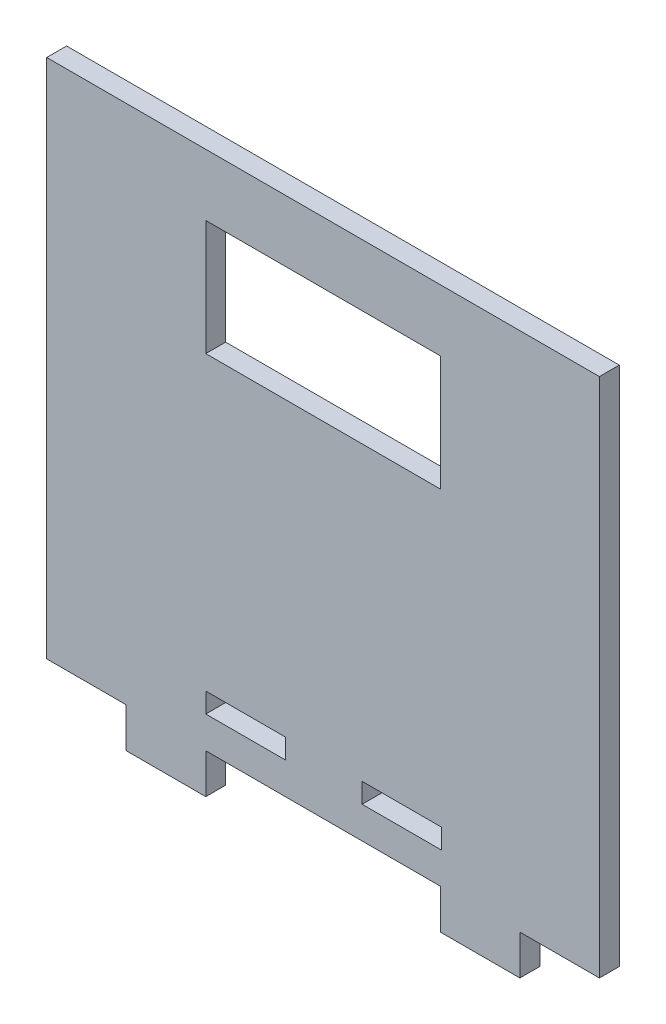
ISO-10303-21;
HEADER;
FILE_DESCRIPTION(('STEP AP214'),'2;1');
FILE_NAME('part.step','',(''),(''),'','','');
FILE_SCHEMA(('AUTOMOTIVE_DESIGN { 1 0 10303 214 1 1 1 1 }'));
ENDSEC;
DATA;
#1=APPLICATION_CONTEXT('core data for automotive mechanical design processes');
#2=APPLICATION_PROTOCOL_DEFINITION('international standard','automotive_design',2000,#1);
#3=PRODUCT_CONTEXT('',#1,'mechanical');
#4=PRODUCT('Part','Part','',(#3));
#5=PRODUCT_RELATED_PRODUCT_CATEGORY('part','',(#4));
#6=PRODUCT_DEFINITION_FORMATION('','',#4);
#7=PRODUCT_DEFINITION_CONTEXT('part definition',#1,'design');
#8=PRODUCT_DEFINITION('design','',#6,#7);
#9=PRODUCT_DEFINITION_SHAPE('','',#8);
#10=(LENGTH_UNIT() NAMED_UNIT(*) SI_UNIT(.MILLI.,.METRE.));
#11=(NAMED_UNIT(*) PLANE_ANGLE_UNIT() SI_UNIT($,.RADIAN.));
#12=(NAMED_UNIT(*) SI_UNIT($,.STERADIAN.) SOLID_ANGLE_UNIT());
#13=UNCERTAINTY_MEASURE_WITH_UNIT(LENGTH_MEASURE(1.E-05),#10,'distance_accuracy_value','');
#14=(GEOMETRIC_REPRESENTATION_CONTEXT(3) GLOBAL_UNCERTAINTY_ASSIGNED_CONTEXT((#13)) GLOBAL_UNIT_ASSIGNED_CONTEXT((#10,
#11,#12)) REPRESENTATION_CONTEXT('',''));
#15=CARTESIAN_POINT('',(0.,0.,0.));
#16=DIRECTION('',(0.,0.,1.));
#17=DIRECTION('',(1.,0.,0.));
#18=AXIS2_PLACEMENT_3D('',#15,#16,#17);
#19=CARTESIAN_POINT('',(0.,-57.5,5.));
#20=DIRECTION('',(0.,-1.,0.));
#21=DIRECTION('',(0.,0.,-1.));
#22=AXIS2_PLACEMENT_3D('',#19,#20,#21);
#23=PLANE('',#22);
#24=DIRECTION('',(-1.,0.,0.));
#25=VECTOR('',#24,1.);
#26=CARTESIAN_POINT('',(0.,-57.5,0.));
#27=LINE('',#26,#25);
#28=CARTESIAN_POINT('',(29.8195040588012,-57.5,0.));
#29=VERTEX_POINT('',#28);
#30=CARTESIAN_POINT('',(9.81950405880117,-57.5,0.));
#31=VERTEX_POINT('',#30);
#32=EDGE_CURVE('E282',#29,#31,#27,.T.);
#33=ORIENTED_EDGE('',*,*,#32,.T.);
#34=DIRECTION('',(0.,0.,-1.));
#35=VECTOR('',#34,1.);
#36=CARTESIAN_POINT('',(9.81950405880117,-57.5,5.));
#37=LINE('',#36,#35);
#38=CARTESIAN_POINT('',(9.81950405880117,-57.5,5.));
#39=VERTEX_POINT('',#38);
#40=EDGE_CURVE('E11',#39,#31,#37,.T.);
#41=ORIENTED_EDGE('',*,*,#40,.F.);
#42=DIRECTION('',(-1.,0.,0.));
#43=VECTOR('',#42,1.);
#44=CARTESIAN_POINT('',(0.,-57.5,5.));
#45=LINE('',#44,#43);
#46=CARTESIAN_POINT('',(29.8195040588012,-57.5,5.));
#47=VERTEX_POINT('',#46);
#48=EDGE_CURVE('E210',#47,#39,#45,.T.);
#49=ORIENTED_EDGE('',*,*,#48,.F.);
#50=DIRECTION('',(0.,0.,-1.));
#51=VECTOR('',#50,1.);
#52=CARTESIAN_POINT('',(29.8195040588012,-57.5,5.));
#53=LINE('',#52,#51);
#54=EDGE_CURVE('E54',#47,#29,#53,.T.);
#55=ORIENTED_EDGE('',*,*,#54,.T.);
#56=EDGE_LOOP('',(#33,#41,#49,#55));
#57=FACE_BOUND('',#56,.T.);
#58=ADVANCED_FACE('F35',(#57),#23,.F.);
#59=CARTESIAN_POINT('',(9.81950405880117,0.,5.));
#60=DIRECTION('',(-1.,0.,0.));
#61=DIRECTION('',(0.,0.,1.));
#62=AXIS2_PLACEMENT_3D('',#59,#60,#61);
#63=PLANE('',#62);
#64=DIRECTION('',(0.,1.,0.));
#65=VECTOR('',#64,1.);
#66=CARTESIAN_POINT('',(9.81950405880117,0.,0.));
#67=LINE('',#66,#65);
#68=CARTESIAN_POINT('',(9.81950405880117,-52.5,0.));
#69=VERTEX_POINT('',#68);
#70=EDGE_CURVE('E216',#31,#69,#67,.T.);
#71=ORIENTED_EDGE('',*,*,#70,.T.);
#72=DIRECTION('',(0.,0.,-1.));
#73=VECTOR('',#72,1.);
#74=CARTESIAN_POINT('',(9.81950405880117,-52.5,5.));
#75=LINE('',#74,#73);
#76=CARTESIAN_POINT('',(9.81950405880117,-52.5,5.));
#77=VERTEX_POINT('',#76);
#78=EDGE_CURVE('E45',#77,#69,#75,.T.);
#79=ORIENTED_EDGE('',*,*,#78,.F.);
#80=DIRECTION('',(0.,1.,0.));
#81=VECTOR('',#80,1.);
#82=CARTESIAN_POINT('',(9.81950405880117,0.,5.));
#83=LINE('',#82,#81);
#84=EDGE_CURVE('E204',#39,#77,#83,.T.);
#85=ORIENTED_EDGE('',*,*,#84,.F.);
#86=ORIENTED_EDGE('',*,*,#40,.T.);
#87=EDGE_LOOP('',(#71,#79,#85,#86));
#88=FACE_BOUND('',#87,.T.);
#89=ADVANCED_FACE('F215',(#88),#63,.F.);
#90=CARTESIAN_POINT('',(0.,-52.5,5.));
#91=DIRECTION('',(0.,-1.,0.));
#92=DIRECTION('',(0.,0.,-1.));
#93=AXIS2_PLACEMENT_3D('',#90,#91,#92);
#94=PLANE('',#93);
#95=DIRECTION('',(-1.,0.,0.));
#96=VECTOR('',#95,1.);
#97=CARTESIAN_POINT('',(0.,-52.5,0.));
#98=LINE('',#97,#96);
#99=CARTESIAN_POINT('',(29.8195040588012,-52.5,0.));
#100=VERTEX_POINT('',#99);
#101=EDGE_CURVE('E285',#100,#69,#98,.T.);
#102=ORIENTED_EDGE('',*,*,#101,.F.);
#103=DIRECTION('',(0.,0.,-1.));
#104=VECTOR('',#103,1.);
#105=CARTESIAN_POINT('',(29.8195040588012,-52.5,5.));
#106=LINE('',#105,#104);
#107=CARTESIAN_POINT('',(29.8195040588012,-52.5,5.));
#108=VERTEX_POINT('',#107);
#109=EDGE_CURVE('E128',#108,#100,#106,.T.);
#110=ORIENTED_EDGE('',*,*,#109,.F.);
#111=DIRECTION('',(-1.,0.,0.));
#112=VECTOR('',#111,1.);
#113=CARTESIAN_POINT('',(0.,-52.5,5.));
#114=LINE('',#113,#112);
#115=EDGE_CURVE('E209',#108,#77,#114,.T.);
#116=ORIENTED_EDGE('',*,*,#115,.T.);
#117=ORIENTED_EDGE('',*,*,#78,.T.);
#118=EDGE_LOOP('',(#102,#110,#116,#117));
#119=FACE_BOUND('',#118,.T.);
#120=ADVANCED_FACE('F220',(#119),#94,.T.);
#121=CARTESIAN_POINT('',(69.5,0.,5.));
#122=DIRECTION('',(1.,0.,0.));
#123=DIRECTION('',(0.,0.,-1.));
#124=AXIS2_PLACEMENT_3D('',#121,#122,#123);
#125=PLANE('',#124);
#126=DIRECTION('',(0.,-1.,0.));
#127=VECTOR('',#126,1.);
#128=CARTESIAN_POINT('',(69.5,0.,0.));
#129=LINE('',#128,#127);
#130=CARTESIAN_POINT('',(69.5,65.5,0.));
#131=VERTEX_POINT('',#130);
#132=CARTESIAN_POINT('',(69.5,-65.5,0.));
#133=VERTEX_POINT('',#132);
#134=EDGE_CURVE('E250',#131,#133,#129,.T.);
#135=ORIENTED_EDGE('',*,*,#134,.F.);
#136=DIRECTION('',(0.,0.,-1.));
#137=VECTOR('',#136,1.);
#138=CARTESIAN_POINT('',(69.5,65.5,5.));
#139=LINE('',#138,#137);
#140=CARTESIAN_POINT('',(69.5,65.5,5.));
#141=VERTEX_POINT('',#140);
#142=EDGE_CURVE('E292',#141,#131,#139,.T.);
#143=ORIENTED_EDGE('',*,*,#142,.F.);
#144=DIRECTION('',(0.,-1.,0.));
#145=VECTOR('',#144,1.);
#146=CARTESIAN_POINT('',(69.5,0.,5.));
#147=LINE('',#146,#145);
#148=CARTESIAN_POINT('',(69.5,-65.5,5.));
#149=VERTEX_POINT('',#148);
#150=EDGE_CURVE('E372',#141,#149,#147,.T.);
#151=ORIENTED_EDGE('',*,*,#150,.T.);
#152=DIRECTION('',(0.,0.,-1.));
#153=VECTOR('',#152,1.);
#154=CARTESIAN_POINT('',(69.5,-65.5,5.));
#155=LINE('',#154,#153);
#156=EDGE_CURVE('E294',#149,#133,#155,.T.);
#157=ORIENTED_EDGE('',*,*,#156,.T.);
#158=EDGE_LOOP('',(#135,#143,#151,#157));
#159=FACE_BOUND('',#158,.T.);
#160=ADVANCED_FACE('F429',(#159),#125,.T.);
#161=CARTESIAN_POINT('',(0.,65.5,5.));
#162=DIRECTION('',(0.,1.,0.));
#163=DIRECTION('',(0.,0.,1.));
#164=AXIS2_PLACEMENT_3D('',#161,#162,#163);
#165=PLANE('',#164);
#166=DIRECTION('',(1.,0.,0.));
#167=VECTOR('',#166,1.);
#168=CARTESIAN_POINT('',(0.,65.5,0.));
#169=LINE('',#168,#167);
#170=CARTESIAN_POINT('',(-69.5,65.5,0.));
#171=VERTEX_POINT('',#170);
#172=EDGE_CURVE('E253',#171,#131,#169,.T.);
#173=ORIENTED_EDGE('',*,*,#172,.F.);
#174=DIRECTION('',(0.,0.,-1.));
#175=VECTOR('',#174,1.);
#176=CARTESIAN_POINT('',(-69.5,65.5,5.));
#177=LINE('',#176,#175);
#178=CARTESIAN_POINT('',(-69.5,65.5,5.));
#179=VERTEX_POINT('',#178);
#180=EDGE_CURVE('E320',#179,#171,#177,.T.);
#181=ORIENTED_EDGE('',*,*,#180,.F.);
#182=DIRECTION('',(1.,0.,0.));
#183=VECTOR('',#182,1.);
#184=CARTESIAN_POINT('',(0.,65.5,5.));
#185=LINE('',#184,#183);
#186=EDGE_CURVE('E375',#179,#141,#185,.T.);
#187=ORIENTED_EDGE('',*,*,#186,.T.);
#188=ORIENTED_EDGE('',*,*,#142,.T.);
#189=EDGE_LOOP('',(#173,#181,#187,#188));
#190=FACE_BOUND('',#189,.T.);
#191=ADVANCED_FACE('F433',(#190),#165,.T.);
#192=CARTESIAN_POINT('',(-69.5,0.,5.));
#193=DIRECTION('',(1.,0.,0.));
#194=DIRECTION('',(0.,0.,-1.));
#195=AXIS2_PLACEMENT_3D('',#192,#193,#194);
#196=PLANE('',#195);
#197=DIRECTION('',(0.,-1.,0.));
#198=VECTOR('',#197,1.);
#199=CARTESIAN_POINT('',(-69.5,0.,0.));
#200=LINE('',#199,#198);
#201=CARTESIAN_POINT('',(-69.5,-65.5,0.));
#202=VERTEX_POINT('',#201);
#203=EDGE_CURVE('E256',#171,#202,#200,.T.);
#204=ORIENTED_EDGE('',*,*,#203,.T.);
#205=DIRECTION('',(0.,0.,-1.));
#206=VECTOR('',#205,1.);
#207=CARTESIAN_POINT('',(-69.5,-65.5,5.));
#208=LINE('',#207,#206);
#209=CARTESIAN_POINT('',(-69.5,-65.5,5.));
#210=VERTEX_POINT('',#209);
#211=EDGE_CURVE('E317',#210,#202,#208,.T.);
#212=ORIENTED_EDGE('',*,*,#211,.F.);
#213=DIRECTION('',(0.,-1.,0.));
#214=VECTOR('',#213,1.);
#215=CARTESIAN_POINT('',(-69.5,0.,5.));
#216=LINE('',#215,#214);
#217=EDGE_CURVE('E378',#179,#210,#216,.T.);
#218=ORIENTED_EDGE('',*,*,#217,.F.);
#219=ORIENTED_EDGE('',*,*,#180,.T.);
#220=EDGE_LOOP('',(#204,#212,#218,#219));
#221=FACE_BOUND('',#220,.T.);
#222=ADVANCED_FACE('F438',(#221),#196,.F.);
#223=CARTESIAN_POINT('',(0.,-65.5,5.));
#224=DIRECTION('',(0.,1.,0.));
#225=DIRECTION('',(0.,0.,1.));
#226=AXIS2_PLACEMENT_3D('',#223,#224,#225);
#227=PLANE('',#226);
#228=DIRECTION('',(1.,0.,0.));
#229=VECTOR('',#228,1.);
#230=CARTESIAN_POINT('',(0.,-65.5,0.));
#231=LINE('',#230,#229);
#232=CARTESIAN_POINT('',(-49.5,-65.5,0.));
#233=VERTEX_POINT('',#232);
#234=EDGE_CURVE('E259',#202,#233,#231,.T.);
#235=ORIENTED_EDGE('',*,*,#234,.T.);
#236=DIRECTION('',(0.,0.,-1.));
#237=VECTOR('',#236,1.);
#238=CARTESIAN_POINT('',(-49.5,-65.5,5.));
#239=LINE('',#238,#237);
#240=CARTESIAN_POINT('',(-49.5,-65.5,5.));
#241=VERTEX_POINT('',#240);
#242=EDGE_CURVE('E314',#241,#233,#239,.T.);
#243=ORIENTED_EDGE('',*,*,#242,.F.);
#244=DIRECTION('',(1.,0.,0.));
#245=VECTOR('',#244,1.);
#246=CARTESIAN_POINT('',(0.,-65.5,5.));
#247=LINE('',#246,#245);
#248=EDGE_CURVE('E381',#210,#241,#247,.T.);
#249=ORIENTED_EDGE('',*,*,#248,.F.);
#250=ORIENTED_EDGE('',*,*,#211,.T.);
#251=EDGE_LOOP('',(#235,#243,#249,#250));
#252=FACE_BOUND('',#251,.T.);
#253=ADVANCED_FACE('F442',(#252),#227,.F.);
#254=CARTESIAN_POINT('',(-49.5,0.,5.));
#255=DIRECTION('',(1.,0.,0.));
#256=DIRECTION('',(0.,0.,-1.));
#257=AXIS2_PLACEMENT_3D('',#254,#255,#256);
#258=PLANE('',#257);
#259=DIRECTION('',(0.,-1.,0.));
#260=VECTOR('',#259,1.);
#261=CARTESIAN_POINT('',(-49.5,0.,0.));
#262=LINE('',#261,#260);
#263=CARTESIAN_POINT('',(-49.5,-75.5,0.));
#264=VERTEX_POINT('',#263);
#265=EDGE_CURVE('E262',#233,#264,#262,.T.);
#266=ORIENTED_EDGE('',*,*,#265,.T.);
#267=DIRECTION('',(0.,0.,-1.));
#268=VECTOR('',#267,1.);
#269=CARTESIAN_POINT('',(-49.5,-75.5,5.));
#270=LINE('',#269,#268);
#271=CARTESIAN_POINT('',(-49.5,-75.5,5.));
#272=VERTEX_POINT('',#271);
#273=EDGE_CURVE('E311',#272,#264,#270,.T.);
#274=ORIENTED_EDGE('',*,*,#273,.F.);
#275=DIRECTION('',(0.,-1.,0.));
#276=VECTOR('',#275,1.);
#277=CARTESIAN_POINT('',(-49.5,0.,5.));
#278=LINE('',#277,#276);
#279=EDGE_CURVE('E384',#241,#272,#278,.T.);
#280=ORIENTED_EDGE('',*,*,#279,.F.);
#281=ORIENTED_EDGE('',*,*,#242,.T.);
#282=EDGE_LOOP('',(#266,#274,#280,#281));
#283=FACE_BOUND('',#282,.T.);
#284=ADVANCED_FACE('F444',(#283),#258,.F.);
#285=CARTESIAN_POINT('',(0.,-75.5,5.));
#286=DIRECTION('',(0.,1.,0.));
#287=DIRECTION('',(0.,0.,1.));
#288=AXIS2_PLACEMENT_3D('',#285,#286,#287);
#289=PLANE('',#288);
#290=DIRECTION('',(1.,0.,0.));
#291=VECTOR('',#290,1.);
#292=CARTESIAN_POINT('',(0.,-75.5,0.));
#293=LINE('',#292,#291);
#294=CARTESIAN_POINT('',(-29.5,-75.5,0.));
#295=VERTEX_POINT('',#294);
#296=EDGE_CURVE('E267',#264,#295,#293,.T.);
#297=ORIENTED_EDGE('',*,*,#296,.T.);
#298=DIRECTION('',(0.,0.,-1.));
#299=VECTOR('',#298,1.);
#300=CARTESIAN_POINT('',(-29.5,-75.5,5.));
#301=LINE('',#300,#299);
#302=CARTESIAN_POINT('',(-29.5,-75.5,5.));
#303=VERTEX_POINT('',#302);
#304=EDGE_CURVE('E309',#303,#295,#301,.T.);
#305=ORIENTED_EDGE('',*,*,#304,.F.);
#306=DIRECTION('',(1.,0.,0.));
#307=VECTOR('',#306,1.);
#308=CARTESIAN_POINT('',(0.,-75.5,5.));
#309=LINE('',#308,#307);
#310=EDGE_CURVE('E389',#272,#303,#309,.T.);
#311=ORIENTED_EDGE('',*,*,#310,.F.);
#312=ORIENTED_EDGE('',*,*,#273,.T.);
#313=EDGE_LOOP('',(#297,#305,#311,#312));
#314=FACE_BOUND('',#313,.T.);
#315=ADVANCED_FACE('F446',(#314),#289,.F.);
#316=CARTESIAN_POINT('',(-29.5,0.,5.));
#317=DIRECTION('',(1.,0.,0.));
#318=DIRECTION('',(0.,0.,-1.));
#319=AXIS2_PLACEMENT_3D('',#316,#317,#318);
#320=PLANE('',#319);
#321=DIRECTION('',(0.,-1.,0.));
#322=VECTOR('',#321,1.);
#323=CARTESIAN_POINT('',(-29.5,0.,0.));
#324=LINE('',#323,#322);
#325=CARTESIAN_POINT('',(-29.5,-65.5,0.));
#326=VERTEX_POINT('',#325);
#327=EDGE_CURVE('E270',#326,#295,#324,.T.);
#328=ORIENTED_EDGE('',*,*,#327,.F.);
#329=DIRECTION('',(0.,0.,-1.));
#330=VECTOR('',#329,1.);
#331=CARTESIAN_POINT('',(-29.5,-65.5,5.));
#332=LINE('',#331,#330);
#333=CARTESIAN_POINT('',(-29.5,-65.5,5.));
#334=VERTEX_POINT('',#333);
#335=EDGE_CURVE('E307',#334,#326,#332,.T.);
#336=ORIENTED_EDGE('',*,*,#335,.F.);
#337=DIRECTION('',(0.,-1.,0.));
#338=VECTOR('',#337,1.);
#339=CARTESIAN_POINT('',(-29.5,0.,5.));
#340=LINE('',#339,#338);
#341=EDGE_CURVE('E391',#334,#303,#340,.T.);
#342=ORIENTED_EDGE('',*,*,#341,.T.);
#343=ORIENTED_EDGE('',*,*,#304,.T.);
#344=EDGE_LOOP('',(#328,#336,#342,#343));
#345=FACE_BOUND('',#344,.T.);
#346=ADVANCED_FACE('F450',(#345),#320,.T.);
#347=CARTESIAN_POINT('',(29.5,-65.5,0.));
#348=VERTEX_POINT('',#347);
#349=EDGE_CURVE('E264',#326,#348,#231,.T.);
#350=ORIENTED_EDGE('',*,*,#349,.T.);
#351=DIRECTION('',(0.,0.,-1.));
#352=VECTOR('',#351,1.);
#353=CARTESIAN_POINT('',(29.5,-65.5,5.));
#354=LINE('',#353,#352);
#355=CARTESIAN_POINT('',(29.5,-65.5,5.));
#356=VERTEX_POINT('',#355);
#357=EDGE_CURVE('E304',#356,#348,#354,.T.);
#358=ORIENTED_EDGE('',*,*,#357,.F.);
#359=EDGE_CURVE('E386',#334,#356,#247,.T.);
#360=ORIENTED_EDGE('',*,*,#359,.F.);
#361=ORIENTED_EDGE('',*,*,#335,.T.);
#362=EDGE_LOOP('',(#350,#358,#360,#361));
#363=FACE_BOUND('',#362,.T.);
#364=ADVANCED_FACE('F413',(#363),#227,.F.);
#365=CARTESIAN_POINT('',(29.5,0.,5.));
#366=DIRECTION('',(1.,0.,0.));
#367=DIRECTION('',(0.,1.,0.));
#368=AXIS2_PLACEMENT_3D('',#365,#366,#367);
#369=PLANE('',#368);
#370=DIRECTION('',(0.,-1.,0.));
#371=VECTOR('',#370,1.);
#372=CARTESIAN_POINT('',(29.5,0.,0.));
#373=LINE('',#372,#371);
#374=CARTESIAN_POINT('',(29.5,-75.5,0.));
#375=VERTEX_POINT('',#374);
#376=EDGE_CURVE('E273',#348,#375,#373,.T.);
#377=ORIENTED_EDGE('',*,*,#376,.T.);
#378=DIRECTION('',(0.,0.,-1.));
#379=VECTOR('',#378,1.);
#380=CARTESIAN_POINT('',(29.5,-75.5,5.));
#381=LINE('',#380,#379);
#382=CARTESIAN_POINT('',(29.5,-75.5,5.));
#383=VERTEX_POINT('',#382);
#384=EDGE_CURVE('E301',#383,#375,#381,.T.);
#385=ORIENTED_EDGE('',*,*,#384,.F.);
#386=DIRECTION('',(0.,-1.,0.));
#387=VECTOR('',#386,1.);
#388=CARTESIAN_POINT('',(29.5,0.,5.));
#389=LINE('',#388,#387);
#390=EDGE_CURVE('E394',#356,#383,#389,.T.);
#391=ORIENTED_EDGE('',*,*,#390,.F.);
#392=ORIENTED_EDGE('',*,*,#357,.T.);
#393=EDGE_LOOP('',(#377,#385,#391,#392));
#394=FACE_BOUND('',#393,.T.);
#395=ADVANCED_FACE('F416',(#394),#369,.F.);
#396=CARTESIAN_POINT('',(0.,-75.5,5.));
#397=DIRECTION('',(0.,1.,0.));
#398=DIRECTION('',(0.,0.,1.));
#399=AXIS2_PLACEMENT_3D('',#396,#397,#398);
#400=PLANE('',#399);
#401=DIRECTION('',(1.,0.,0.));
#402=VECTOR('',#401,1.);
#403=CARTESIAN_POINT('',(0.,-75.5,0.));
#404=LINE('',#403,#402);
#405=CARTESIAN_POINT('',(49.5,-75.5,0.));
#406=VERTEX_POINT('',#405);
#407=EDGE_CURVE('E276',#375,#406,#404,.T.);
#408=ORIENTED_EDGE('',*,*,#407,.T.);
#409=DIRECTION('',(0.,0.,-1.));
#410=VECTOR('',#409,1.);
#411=CARTESIAN_POINT('',(49.5,-75.5,5.));
#412=LINE('',#411,#410);
#413=CARTESIAN_POINT('',(49.5,-75.5,5.));
#414=VERTEX_POINT('',#413);
#415=EDGE_CURVE('E299',#414,#406,#412,.T.);
#416=ORIENTED_EDGE('',*,*,#415,.F.);
#417=DIRECTION('',(1.,0.,0.));
#418=VECTOR('',#417,1.);
#419=CARTESIAN_POINT('',(0.,-75.5,5.));
#420=LINE('',#419,#418);
#421=EDGE_CURVE('E397',#383,#414,#420,.T.);
#422=ORIENTED_EDGE('',*,*,#421,.F.);
#423=ORIENTED_EDGE('',*,*,#384,.T.);
#424=EDGE_LOOP('',(#408,#416,#422,#423));
#425=FACE_BOUND('',#424,.T.);
#426=ADVANCED_FACE('F418',(#425),#400,.F.);
#427=CARTESIAN_POINT('',(49.5,0.,5.));
#428=DIRECTION('',(1.,0.,0.));
#429=DIRECTION('',(0.,1.,0.));
#430=AXIS2_PLACEMENT_3D('',#427,#428,#429);
#431=PLANE('',#430);
#432=DIRECTION('',(0.,-1.,0.));
#433=VECTOR('',#432,1.);
#434=CARTESIAN_POINT('',(49.5,0.,0.));
#435=LINE('',#434,#433);
#436=CARTESIAN_POINT('',(49.5,-65.5,0.));
#437=VERTEX_POINT('',#436);
#438=EDGE_CURVE('E279',#437,#406,#435,.T.);
#439=ORIENTED_EDGE('',*,*,#438,.F.);
#440=DIRECTION('',(0.,0.,-1.));
#441=VECTOR('',#440,1.);
#442=CARTESIAN_POINT('',(49.5,-65.5,5.));
#443=LINE('',#442,#441);
#444=CARTESIAN_POINT('',(49.5,-65.5,5.));
#445=VERTEX_POINT('',#444);
#446=EDGE_CURVE('E296',#445,#437,#443,.T.);
#447=ORIENTED_EDGE('',*,*,#446,.F.);
#448=DIRECTION('',(0.,-1.,0.));
#449=VECTOR('',#448,1.);
#450=CARTESIAN_POINT('',(49.5,0.,5.));
#451=LINE('',#450,#449);
#452=EDGE_CURVE('E399',#445,#414,#451,.T.);
#453=ORIENTED_EDGE('',*,*,#452,.T.);
#454=ORIENTED_EDGE('',*,*,#415,.T.);
#455=EDGE_LOOP('',(#439,#447,#453,#454));
#456=FACE_BOUND('',#455,.T.);
#457=ADVANCED_FACE('F422',(#456),#431,.T.);
#458=CARTESIAN_POINT('',(-9.50000000000002,0.,5.));
#459=DIRECTION('',(-1.,0.,0.));
#460=DIRECTION('',(0.,0.,1.));
#461=AXIS2_PLACEMENT_3D('',#458,#459,#460);
#462=PLANE('',#461);
#463=DIRECTION('',(0.,1.,0.));
#464=VECTOR('',#463,1.);
#465=CARTESIAN_POINT('',(-9.50000000000002,0.,0.));
#466=LINE('',#465,#464);
#467=CARTESIAN_POINT('',(-9.50000000000002,-57.5,0.));
#468=VERTEX_POINT('',#467);
#469=CARTESIAN_POINT('',(-9.50000000000002,-52.5,0.));
#470=VERTEX_POINT('',#469);
#471=EDGE_CURVE('E238',#468,#470,#466,.T.);
#472=ORIENTED_EDGE('',*,*,#471,.F.);
#473=DIRECTION('',(0.,0.,-1.));
#474=VECTOR('',#473,1.);
#475=CARTESIAN_POINT('',(-9.50000000000002,-57.5,5.));
#476=LINE('',#475,#474);
#477=CARTESIAN_POINT('',(-9.50000000000002,-57.5,5.));
#478=VERTEX_POINT('',#477);
#479=EDGE_CURVE('E297',#478,#468,#476,.T.);
#480=ORIENTED_EDGE('',*,*,#479,.F.);
#481=DIRECTION('',(0.,1.,0.));
#482=VECTOR('',#481,1.);
#483=CARTESIAN_POINT('',(-9.50000000000002,0.,5.));
#484=LINE('',#483,#482);
#485=CARTESIAN_POINT('',(-9.50000000000002,-52.5,5.));
#486=VERTEX_POINT('',#485);
#487=EDGE_CURVE('E356',#478,#486,#484,.T.);
#488=ORIENTED_EDGE('',*,*,#487,.T.);
#489=DIRECTION('',(0.,0.,-1.));
#490=VECTOR('',#489,1.);
#491=CARTESIAN_POINT('',(-9.50000000000002,-52.5,5.));
#492=LINE('',#491,#490);
#493=EDGE_CURVE('E323',#486,#470,#492,.T.);
#494=ORIENTED_EDGE('',*,*,#493,.T.);
#495=EDGE_LOOP('',(#472,#480,#488,#494));
#496=FACE_BOUND('',#495,.T.);
#497=ADVANCED_FACE('F477',(#496),#462,.T.);
#498=CARTESIAN_POINT('',(0.,-57.5,5.));
#499=DIRECTION('',(0.,1.,0.));
#500=DIRECTION('',(0.,0.,1.));
#501=AXIS2_PLACEMENT_3D('',#498,#499,#500);
#502=PLANE('',#501);
#503=DIRECTION('',(1.,0.,0.));
#504=VECTOR('',#503,1.);
#505=CARTESIAN_POINT('',(0.,-57.5,0.));
#506=LINE('',#505,#504);
#507=CARTESIAN_POINT('',(-29.5,-57.5,0.));
#508=VERTEX_POINT('',#507);
#509=EDGE_CURVE('E241',#508,#468,#506,.T.);
#510=ORIENTED_EDGE('',*,*,#509,.F.);
#511=DIRECTION('',(0.,0.,-1.));
#512=VECTOR('',#511,1.);
#513=CARTESIAN_POINT('',(-29.5,-57.5,5.));
#514=LINE('',#513,#512);
#515=CARTESIAN_POINT('',(-29.5,-57.5,5.));
#516=VERTEX_POINT('',#515);
#517=EDGE_CURVE('E328',#516,#508,#514,.T.);
#518=ORIENTED_EDGE('',*,*,#517,.F.);
#519=DIRECTION('',(1.,0.,0.));
#520=VECTOR('',#519,1.);
#521=CARTESIAN_POINT('',(0.,-57.5,5.));
#522=LINE('',#521,#520);
#523=EDGE_CURVE('E360',#516,#478,#522,.T.);
#524=ORIENTED_EDGE('',*,*,#523,.T.);
#525=ORIENTED_EDGE('',*,*,#479,.T.);
#526=EDGE_LOOP('',(#510,#518,#524,#525));
#527=FACE_BOUND('',#526,.T.);
#528=ADVANCED_FACE('F500',(#527),#502,.T.);
#529=CARTESIAN_POINT('',(-29.5,0.,5.));
#530=DIRECTION('',(-1.,0.,0.));
#531=DIRECTION('',(0.,0.,1.));
#532=AXIS2_PLACEMENT_3D('',#529,#530,#531);
#533=PLANE('',#532);
#534=DIRECTION('',(0.,1.,0.));
#535=VECTOR('',#534,1.);
#536=CARTESIAN_POINT('',(-29.5,0.,0.));
#537=LINE('',#536,#535);
#538=CARTESIAN_POINT('',(-29.5,-52.5,0.));
#539=VERTEX_POINT('',#538);
#540=EDGE_CURVE('E244',#508,#539,#537,.T.);
#541=ORIENTED_EDGE('',*,*,#540,.T.);
#542=DIRECTION('',(0.,0.,-1.));
#543=VECTOR('',#542,1.);
#544=CARTESIAN_POINT('',(-29.5,-52.5,5.));
#545=LINE('',#544,#543);
#546=CARTESIAN_POINT('',(-29.5,-52.5,5.));
#547=VERTEX_POINT('',#546);
#548=EDGE_CURVE('E325',#547,#539,#545,.T.);
#549=ORIENTED_EDGE('',*,*,#548,.F.);
#550=DIRECTION('',(0.,1.,0.));
#551=VECTOR('',#550,1.);
#552=CARTESIAN_POINT('',(-29.5,0.,5.));
#553=LINE('',#552,#551);
#554=EDGE_CURVE('E367',#516,#547,#553,.T.);
#555=ORIENTED_EDGE('',*,*,#554,.F.);
#556=ORIENTED_EDGE('',*,*,#517,.T.);
#557=EDGE_LOOP('',(#541,#549,#555,#556));
#558=FACE_BOUND('',#557,.T.);
#559=ADVANCED_FACE('F497',(#558),#533,.F.);
#560=CARTESIAN_POINT('',(-29.5,0.,5.));
#561=DIRECTION('',(1.,0.,0.));
#562=DIRECTION('',(0.,1.,0.));
#563=AXIS2_PLACEMENT_3D('',#560,#561,#562);
#564=PLANE('',#563);
#565=DIRECTION('',(0.,-1.,0.));
#566=VECTOR('',#565,1.);
#567=CARTESIAN_POINT('',(-29.5,0.,0.));
#568=LINE('',#567,#566);
#569=CARTESIAN_POINT('',(-29.5,50.,0.));
#570=VERTEX_POINT('',#569);
#571=CARTESIAN_POINT('',(-29.5,21.,0.));
#572=VERTEX_POINT('',#571);
#573=EDGE_CURVE('E227',#570,#572,#568,.T.);
#574=ORIENTED_EDGE('',*,*,#573,.F.);
#575=DIRECTION('',(0.,0.,-1.));
#576=VECTOR('',#575,1.);
#577=CARTESIAN_POINT('',(-29.5,50.,5.));
#578=LINE('',#577,#576);
#579=CARTESIAN_POINT('',(-29.5,50.,5.));
#580=VERTEX_POINT('',#579);
#581=EDGE_CURVE('E39',#580,#570,#578,.T.);
#582=ORIENTED_EDGE('',*,*,#581,.F.);
#583=DIRECTION('',(0.,-1.,0.));
#584=VECTOR('',#583,1.);
#585=CARTESIAN_POINT('',(-29.5,0.,5.));
#586=LINE('',#585,#584);
#587=CARTESIAN_POINT('',(-29.5,21.,5.));
#588=VERTEX_POINT('',#587);
#589=EDGE_CURVE('E290',#580,#588,#586,.T.);
#590=ORIENTED_EDGE('',*,*,#589,.T.);
#591=DIRECTION('',(0.,0.,-1.));
#592=VECTOR('',#591,1.);
#593=CARTESIAN_POINT('',(-29.5,21.,5.));
#594=LINE('',#593,#592);
#595=EDGE_CURVE('E223',#588,#572,#594,.T.);
#596=ORIENTED_EDGE('',*,*,#595,.T.);
#597=EDGE_LOOP('',(#574,#582,#590,#596));
#598=FACE_BOUND('',#597,.T.);
#599=ADVANCED_FACE('F37',(#598),#564,.T.);
#600=CARTESIAN_POINT('',(0.,50.,5.));
#601=DIRECTION('',(0.,-1.,0.));
#602=DIRECTION('',(0.,0.,-1.));
#603=AXIS2_PLACEMENT_3D('',#600,#601,#602);
#604=PLANE('',#603);
#605=DIRECTION('',(-1.,0.,0.));
#606=VECTOR('',#605,1.);
#607=CARTESIAN_POINT('',(0.,50.,0.));
#608=LINE('',#607,#606);
#609=CARTESIAN_POINT('',(29.5,50.,0.));
#610=VERTEX_POINT('',#609);
#611=EDGE_CURVE('E230',#610,#570,#608,.T.);
#612=ORIENTED_EDGE('',*,*,#611,.F.);
#613=DIRECTION('',(0.,0.,-1.));
#614=VECTOR('',#613,1.);
#615=CARTESIAN_POINT('',(29.5,50.,5.));
#616=LINE('',#615,#614);
#617=CARTESIAN_POINT('',(29.5,50.,5.));
#618=VERTEX_POINT('',#617);
#619=EDGE_CURVE('E334',#618,#610,#616,.T.);
#620=ORIENTED_EDGE('',*,*,#619,.F.);
#621=DIRECTION('',(-1.,0.,0.));
#622=VECTOR('',#621,1.);
#623=CARTESIAN_POINT('',(0.,50.,5.));
#624=LINE('',#623,#622);
#625=EDGE_CURVE('E343',#618,#580,#624,.T.);
#626=ORIENTED_EDGE('',*,*,#625,.T.);
#627=ORIENTED_EDGE('',*,*,#581,.T.);
#628=EDGE_LOOP('',(#612,#620,#626,#627));
#629=FACE_BOUND('',#628,.T.);
#630=ADVANCED_FACE('F341',(#629),#604,.T.);
#631=CARTESIAN_POINT('',(29.5,0.,5.));
#632=DIRECTION('',(1.,0.,0.));
#633=DIRECTION('',(0.,1.,0.));
#634=AXIS2_PLACEMENT_3D('',#631,#632,#633);
#635=PLANE('',#634);
#636=DIRECTION('',(0.,-1.,0.));
#637=VECTOR('',#636,1.);
#638=CARTESIAN_POINT('',(29.5,0.,0.));
#639=LINE('',#638,#637);
#640=CARTESIAN_POINT('',(29.5,21.,0.));
#641=VERTEX_POINT('',#640);
#642=EDGE_CURVE('E233',#610,#641,#639,.T.);
#643=ORIENTED_EDGE('',*,*,#642,.T.);
#644=DIRECTION('',(0.,0.,-1.));
#645=VECTOR('',#644,1.);
#646=CARTESIAN_POINT('',(29.5,21.,5.));
#647=LINE('',#646,#645);
#648=CARTESIAN_POINT('',(29.5,21.,5.));
#649=VERTEX_POINT('',#648);
#650=EDGE_CURVE('E332',#649,#641,#647,.T.);
#651=ORIENTED_EDGE('',*,*,#650,.F.);
#652=DIRECTION('',(0.,-1.,0.));
#653=VECTOR('',#652,1.);
#654=CARTESIAN_POINT('',(29.5,0.,5.));
#655=LINE('',#654,#653);
#656=EDGE_CURVE('E357',#618,#649,#655,.T.);
#657=ORIENTED_EDGE('',*,*,#656,.F.);
#658=ORIENTED_EDGE('',*,*,#619,.T.);
#659=EDGE_LOOP('',(#643,#651,#657,#658));
#660=FACE_BOUND('',#659,.T.);
#661=ADVANCED_FACE('F350',(#660),#635,.F.);
#662=EDGE_CURVE('E263',#437,#133,#231,.T.);
#663=ORIENTED_EDGE('',*,*,#662,.T.);
#664=ORIENTED_EDGE('',*,*,#156,.F.);
#665=EDGE_CURVE('E385',#445,#149,#247,.T.);
#666=ORIENTED_EDGE('',*,*,#665,.F.);
#667=ORIENTED_EDGE('',*,*,#446,.T.);
#668=EDGE_LOOP('',(#663,#664,#666,#667));
#669=FACE_BOUND('',#668,.T.);
#670=ADVANCED_FACE('F426',(#669),#227,.F.);
#671=CARTESIAN_POINT('',(0.,-52.5,5.));
#672=DIRECTION('',(0.,1.,0.));
#673=DIRECTION('',(0.,0.,1.));
#674=AXIS2_PLACEMENT_3D('',#671,#672,#673);
#675=PLANE('',#674);
#676=DIRECTION('',(1.,0.,0.));
#677=VECTOR('',#676,1.);
#678=CARTESIAN_POINT('',(0.,-52.5,0.));
#679=LINE('',#678,#677);
#680=EDGE_CURVE('E247',#539,#470,#679,.T.);
#681=ORIENTED_EDGE('',*,*,#680,.T.);
#682=ORIENTED_EDGE('',*,*,#493,.F.);
#683=DIRECTION('',(1.,0.,0.));
#684=VECTOR('',#683,1.);
#685=CARTESIAN_POINT('',(0.,-52.5,5.));
#686=LINE('',#685,#684);
#687=EDGE_CURVE('E370',#547,#486,#686,.T.);
#688=ORIENTED_EDGE('',*,*,#687,.F.);
#689=ORIENTED_EDGE('',*,*,#548,.T.);
#690=EDGE_LOOP('',(#681,#682,#688,#689));
#691=FACE_BOUND('',#690,.T.);
#692=ADVANCED_FACE('F463',(#691),#675,.F.);
#693=CARTESIAN_POINT('',(0.,21.,5.));
#694=DIRECTION('',(0.,-1.,0.));
#695=DIRECTION('',(1.,0.,0.));
#696=AXIS2_PLACEMENT_3D('',#693,#694,#695);
#697=PLANE('',#696);
#698=DIRECTION('',(-1.,0.,0.));
#699=VECTOR('',#698,1.);
#700=CARTESIAN_POINT('',(0.,21.,0.));
#701=LINE('',#700,#699);
#702=EDGE_CURVE('E235',#641,#572,#701,.T.);
#703=ORIENTED_EDGE('',*,*,#702,.T.);
#704=ORIENTED_EDGE('',*,*,#595,.F.);
#705=DIRECTION('',(-1.,0.,0.));
#706=VECTOR('',#705,1.);
#707=CARTESIAN_POINT('',(0.,21.,5.));
#708=LINE('',#707,#706);
#709=EDGE_CURVE('E354',#649,#588,#708,.T.);
#710=ORIENTED_EDGE('',*,*,#709,.F.);
#711=ORIENTED_EDGE('',*,*,#650,.T.);
#712=EDGE_LOOP('',(#703,#704,#710,#711));
#713=FACE_BOUND('',#712,.T.);
#714=ADVANCED_FACE('F353',(#713),#697,.F.);
#715=CARTESIAN_POINT('',(29.8195040588012,0.,5.));
#716=DIRECTION('',(-1.,0.,0.));
#717=DIRECTION('',(0.,0.,1.));
#718=AXIS2_PLACEMENT_3D('',#715,#716,#717);
#719=PLANE('',#718);
#720=DIRECTION('',(0.,1.,0.));
#721=VECTOR('',#720,1.);
#722=CARTESIAN_POINT('',(29.8195040588012,0.,0.));
#723=LINE('',#722,#721);
#724=EDGE_CURVE('E287',#29,#100,#723,.T.);
#725=ORIENTED_EDGE('',*,*,#724,.F.);
#726=ORIENTED_EDGE('',*,*,#54,.F.);
#727=DIRECTION('',(0.,1.,0.));
#728=VECTOR('',#727,1.);
#729=CARTESIAN_POINT('',(29.8195040588012,0.,5.));
#730=LINE('',#729,#728);
#731=EDGE_CURVE('E221',#47,#108,#730,.T.);
#732=ORIENTED_EDGE('',*,*,#731,.T.);
#733=ORIENTED_EDGE('',*,*,#109,.T.);
#734=EDGE_LOOP('',(#725,#726,#732,#733));
#735=FACE_BOUND('',#734,.T.);
#736=ADVANCED_FACE('F455',(#735),#719,.T.);
#737=CARTESIAN_POINT('',(0.,0.,5.));
#738=DIRECTION('',(0.,0.,1.));
#739=DIRECTION('',(1.,0.,0.));
#740=AXIS2_PLACEMENT_3D('',#737,#738,#739);
#741=PLANE('',#740);
#742=ORIENTED_EDGE('',*,*,#589,.F.);
#743=ORIENTED_EDGE('',*,*,#625,.F.);
#744=ORIENTED_EDGE('',*,*,#656,.T.);
#745=ORIENTED_EDGE('',*,*,#709,.T.);
#746=EDGE_LOOP('',(#742,#743,#744,#745));
#747=FACE_BOUND('',#746,.T.);
#748=ORIENTED_EDGE('',*,*,#487,.F.);
#749=ORIENTED_EDGE('',*,*,#523,.F.);
#750=ORIENTED_EDGE('',*,*,#554,.T.);
#751=ORIENTED_EDGE('',*,*,#687,.T.);
#752=EDGE_LOOP('',(#748,#749,#750,#751));
#753=FACE_BOUND('',#752,.T.);
#754=ORIENTED_EDGE('',*,*,#150,.F.);
#755=ORIENTED_EDGE('',*,*,#186,.F.);
#756=ORIENTED_EDGE('',*,*,#217,.T.);
#757=ORIENTED_EDGE('',*,*,#248,.T.);
#758=ORIENTED_EDGE('',*,*,#279,.T.);
#759=ORIENTED_EDGE('',*,*,#310,.T.);
#760=ORIENTED_EDGE('',*,*,#341,.F.);
#761=ORIENTED_EDGE('',*,*,#359,.T.);
#762=ORIENTED_EDGE('',*,*,#390,.T.);
#763=ORIENTED_EDGE('',*,*,#421,.T.);
#764=ORIENTED_EDGE('',*,*,#452,.F.);
#765=ORIENTED_EDGE('',*,*,#665,.T.);
#766=EDGE_LOOP('',(#754,#755,#756,#757,#758,#759,#760,#761,#762,#763,#764,#765));
#767=FACE_BOUND('',#766,.T.);
#768=ORIENTED_EDGE('',*,*,#48,.T.);
#769=ORIENTED_EDGE('',*,*,#84,.T.);
#770=ORIENTED_EDGE('',*,*,#115,.F.);
#771=ORIENTED_EDGE('',*,*,#731,.F.);
#772=EDGE_LOOP('',(#768,#769,#770,#771));
#773=FACE_BOUND('',#772,.T.);
#774=ADVANCED_FACE('F206',(#747,#753,#767,#773),#741,.T.);
#775=CARTESIAN_POINT('',(0.,0.,0.));
#776=DIRECTION('',(0.,0.,1.));
#777=DIRECTION('',(1.,0.,0.));
#778=AXIS2_PLACEMENT_3D('',#775,#776,#777);
#779=PLANE('',#778);
#780=ORIENTED_EDGE('',*,*,#573,.T.);
#781=ORIENTED_EDGE('',*,*,#702,.F.);
#782=ORIENTED_EDGE('',*,*,#642,.F.);
#783=ORIENTED_EDGE('',*,*,#611,.T.);
#784=EDGE_LOOP('',(#780,#781,#782,#783));
#785=FACE_BOUND('',#784,.T.);
#786=ORIENTED_EDGE('',*,*,#471,.T.);
#787=ORIENTED_EDGE('',*,*,#680,.F.);
#788=ORIENTED_EDGE('',*,*,#540,.F.);
#789=ORIENTED_EDGE('',*,*,#509,.T.);
#790=EDGE_LOOP('',(#786,#787,#788,#789));
#791=FACE_BOUND('',#790,.T.);
#792=ORIENTED_EDGE('',*,*,#134,.T.);
#793=ORIENTED_EDGE('',*,*,#662,.F.);
#794=ORIENTED_EDGE('',*,*,#438,.T.);
#795=ORIENTED_EDGE('',*,*,#407,.F.);
#796=ORIENTED_EDGE('',*,*,#376,.F.);
#797=ORIENTED_EDGE('',*,*,#349,.F.);
#798=ORIENTED_EDGE('',*,*,#327,.T.);
#799=ORIENTED_EDGE('',*,*,#296,.F.);
#800=ORIENTED_EDGE('',*,*,#265,.F.);
#801=ORIENTED_EDGE('',*,*,#234,.F.);
#802=ORIENTED_EDGE('',*,*,#203,.F.);
#803=ORIENTED_EDGE('',*,*,#172,.T.);
#804=EDGE_LOOP('',(#792,#793,#794,#795,#796,#797,#798,#799,#800,#801,#802,#803));
#805=FACE_BOUND('',#804,.T.);
#806=ORIENTED_EDGE('',*,*,#32,.F.);
#807=ORIENTED_EDGE('',*,*,#724,.T.);
#808=ORIENTED_EDGE('',*,*,#101,.T.);
#809=ORIENTED_EDGE('',*,*,#70,.F.);
#810=EDGE_LOOP('',(#806,#807,#808,#809));
#811=FACE_BOUND('',#810,.T.);
#812=ADVANCED_FACE('F347',(#785,#791,#805,#811),#779,.F.);
#813=CLOSED_SHELL('',(#58,#89,#120,#160,#191,#222,#253,#284,#315,#346,#364,#395,#426,#457,#497,
#528,#559,#599,#630,#661,#670,#692,#714,#736,#774,#812));
#814=MANIFOLD_SOLID_BREP('B2',#813);
#815=ADVANCED_BREP_SHAPE_REPRESENTATION('',(#18,#814),#14);
#816=SHAPE_DEFINITION_REPRESENTATION(#9,#815);
ENDSEC;
END-ISO-10303-21;
